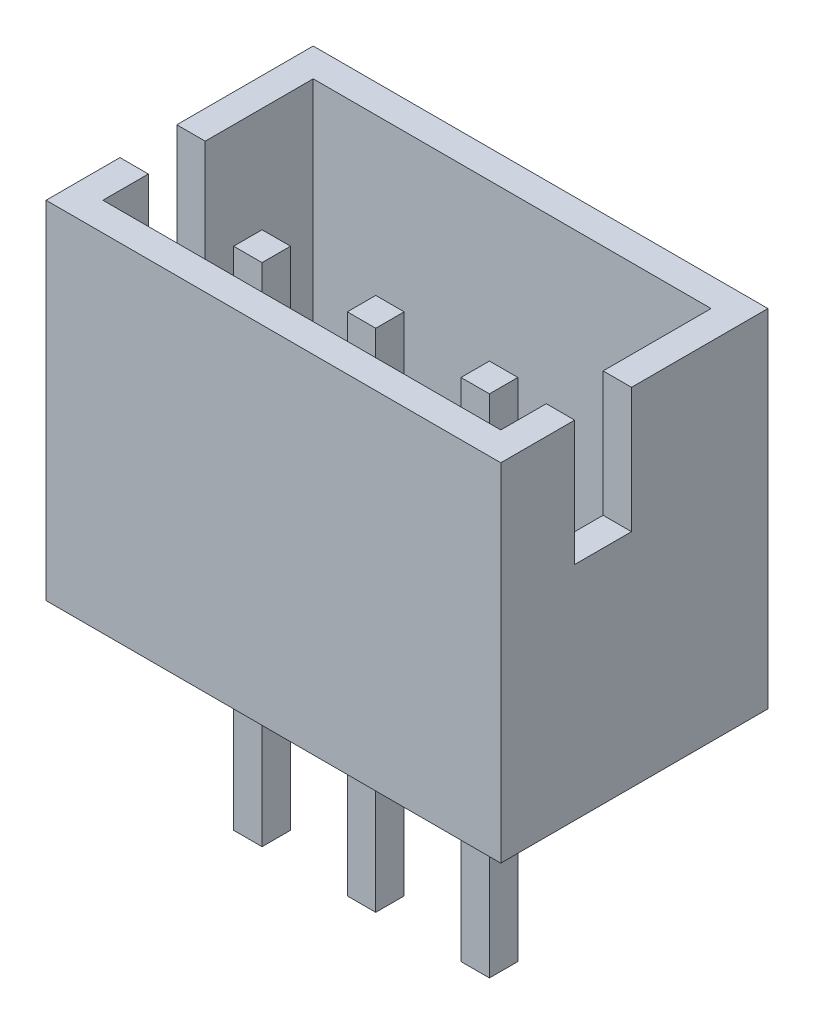
ISO-10303-21;
HEADER;
FILE_DESCRIPTION(('STEP AP214'),'2;1');
FILE_NAME('part.step','',(''),(''),'','','');
FILE_SCHEMA(('AUTOMOTIVE_DESIGN { 1 0 10303 214 1 1 1 1 }'));
ENDSEC;
DATA;
#1=APPLICATION_CONTEXT('core data for automotive mechanical design processes');
#2=APPLICATION_PROTOCOL_DEFINITION('international standard','automotive_design',2000,#1);
#3=PRODUCT_CONTEXT('',#1,'mechanical');
#4=PRODUCT('Part','Part','',(#3));
#5=PRODUCT_RELATED_PRODUCT_CATEGORY('part','',(#4));
#6=PRODUCT_DEFINITION_FORMATION('','',#4);
#7=PRODUCT_DEFINITION_CONTEXT('part definition',#1,'design');
#8=PRODUCT_DEFINITION('design','',#6,#7);
#9=PRODUCT_DEFINITION_SHAPE('','',#8);
#10=(LENGTH_UNIT() NAMED_UNIT(*) SI_UNIT(.MILLI.,.METRE.));
#11=(NAMED_UNIT(*) PLANE_ANGLE_UNIT() SI_UNIT($,.RADIAN.));
#12=(NAMED_UNIT(*) SI_UNIT($,.STERADIAN.) SOLID_ANGLE_UNIT());
#13=UNCERTAINTY_MEASURE_WITH_UNIT(LENGTH_MEASURE(1.E-05),#10,'distance_accuracy_value','');
#14=(GEOMETRIC_REPRESENTATION_CONTEXT(3) GLOBAL_UNCERTAINTY_ASSIGNED_CONTEXT((#13)) GLOBAL_UNIT_ASSIGNED_CONTEXT((#10,
#11,#12)) REPRESENTATION_CONTEXT('',''));
#15=CARTESIAN_POINT('',(0.,0.,0.));
#16=DIRECTION('',(0.,0.,1.));
#17=DIRECTION('',(1.,0.,0.));
#18=AXIS2_PLACEMENT_3D('',#15,#16,#17);
#19=CARTESIAN_POINT('',(2.25,-3.4,0.3));
#20=DIRECTION('',(0.,0.,-1.));
#21=DIRECTION('',(-1.,0.,0.));
#22=AXIS2_PLACEMENT_3D('',#19,#20,#21);
#23=PLANE('',#22);
#24=DIRECTION('',(0.,1.,0.));
#25=VECTOR('',#24,1.);
#26=CARTESIAN_POINT('',(1.75,-3.4,0.3));
#27=LINE('',#26,#25);
#28=CARTESIAN_POINT('',(1.75,-3.4,0.3));
#29=VERTEX_POINT('',#28);
#30=CARTESIAN_POINT('',(1.75,5.5,0.3));
#31=VERTEX_POINT('',#30);
#32=EDGE_CURVE('E53',#29,#31,#27,.T.);
#33=ORIENTED_EDGE('',*,*,#32,.T.);
#34=DIRECTION('',(-1.,0.,0.));
#35=VECTOR('',#34,1.);
#36=CARTESIAN_POINT('',(2.25,5.5,0.3));
#37=LINE('',#36,#35);
#38=CARTESIAN_POINT('',(2.25,5.5,0.3));
#39=VERTEX_POINT('',#38);
#40=EDGE_CURVE('E90',#39,#31,#37,.T.);
#41=ORIENTED_EDGE('',*,*,#40,.F.);
#42=DIRECTION('',(0.,1.,0.));
#43=VECTOR('',#42,1.);
#44=CARTESIAN_POINT('',(2.25,-3.4,0.3));
#45=LINE('',#44,#43);
#46=CARTESIAN_POINT('',(2.25,-3.4,0.3));
#47=VERTEX_POINT('',#46);
#48=EDGE_CURVE('E12',#47,#39,#45,.T.);
#49=ORIENTED_EDGE('',*,*,#48,.F.);
#50=DIRECTION('',(-1.,0.,0.));
#51=VECTOR('',#50,1.);
#52=CARTESIAN_POINT('',(2.25,-3.4,0.3));
#53=LINE('',#52,#51);
#54=EDGE_CURVE('E91',#47,#29,#53,.T.);
#55=ORIENTED_EDGE('',*,*,#54,.T.);
#56=EDGE_LOOP('',(#33,#41,#49,#55));
#57=FACE_BOUND('',#56,.T.);
#58=ADVANCED_FACE('F50',(#57),#23,.T.);
#59=CARTESIAN_POINT('',(2.25,-3.4,0.8));
#60=DIRECTION('',(1.,0.,0.));
#61=DIRECTION('',(0.,0.,-1.));
#62=AXIS2_PLACEMENT_3D('',#59,#60,#61);
#63=PLANE('',#62);
#64=ORIENTED_EDGE('',*,*,#48,.T.);
#65=DIRECTION('',(0.,0.,-1.));
#66=VECTOR('',#65,1.);
#67=CARTESIAN_POINT('',(2.25,5.5,0.8));
#68=LINE('',#67,#66);
#69=CARTESIAN_POINT('',(2.25,5.5,0.8));
#70=VERTEX_POINT('',#69);
#71=EDGE_CURVE('E107',#70,#39,#68,.T.);
#72=ORIENTED_EDGE('',*,*,#71,.F.);
#73=DIRECTION('',(0.,1.,0.));
#74=VECTOR('',#73,1.);
#75=CARTESIAN_POINT('',(2.25,-3.4,0.8));
#76=LINE('',#75,#74);
#77=CARTESIAN_POINT('',(2.25,-3.4,0.8));
#78=VERTEX_POINT('',#77);
#79=EDGE_CURVE('E58',#78,#70,#76,.T.);
#80=ORIENTED_EDGE('',*,*,#79,.F.);
#81=DIRECTION('',(0.,0.,-1.));
#82=VECTOR('',#81,1.);
#83=CARTESIAN_POINT('',(2.25,-3.4,0.8));
#84=LINE('',#83,#82);
#85=EDGE_CURVE('E96',#78,#47,#84,.T.);
#86=ORIENTED_EDGE('',*,*,#85,.T.);
#87=EDGE_LOOP('',(#64,#72,#80,#86));
#88=FACE_BOUND('',#87,.T.);
#89=ADVANCED_FACE('F122',(#88),#63,.T.);
#90=CARTESIAN_POINT('',(2.25,-3.4,0.8));
#91=DIRECTION('',(0.,0.,1.));
#92=DIRECTION('',(1.,0.,0.));
#93=AXIS2_PLACEMENT_3D('',#90,#91,#92);
#94=PLANE('',#93);
#95=ORIENTED_EDGE('',*,*,#79,.T.);
#96=DIRECTION('',(1.,0.,0.));
#97=VECTOR('',#96,1.);
#98=CARTESIAN_POINT('',(2.25,5.5,0.8));
#99=LINE('',#98,#97);
#100=CARTESIAN_POINT('',(1.75,5.5,0.8));
#101=VERTEX_POINT('',#100);
#102=EDGE_CURVE('E103',#101,#70,#99,.T.);
#103=ORIENTED_EDGE('',*,*,#102,.F.);
#104=DIRECTION('',(0.,1.,0.));
#105=VECTOR('',#104,1.);
#106=CARTESIAN_POINT('',(1.75,-3.4,0.8));
#107=LINE('',#106,#105);
#108=CARTESIAN_POINT('',(1.75,-3.4,0.8));
#109=VERTEX_POINT('',#108);
#110=EDGE_CURVE('E95',#109,#101,#107,.T.);
#111=ORIENTED_EDGE('',*,*,#110,.F.);
#112=DIRECTION('',(1.,0.,0.));
#113=VECTOR('',#112,1.);
#114=CARTESIAN_POINT('',(2.25,-3.4,0.8));
#115=LINE('',#114,#113);
#116=EDGE_CURVE('E115',#109,#78,#115,.T.);
#117=ORIENTED_EDGE('',*,*,#116,.T.);
#118=EDGE_LOOP('',(#95,#103,#111,#117));
#119=FACE_BOUND('',#118,.T.);
#120=ADVANCED_FACE('F119',(#119),#94,.T.);
#121=CARTESIAN_POINT('',(1.75,-3.4,0.8));
#122=DIRECTION('',(-1.,0.,0.));
#123=DIRECTION('',(0.,0.,1.));
#124=AXIS2_PLACEMENT_3D('',#121,#122,#123);
#125=PLANE('',#124);
#126=ORIENTED_EDGE('',*,*,#110,.T.);
#127=DIRECTION('',(0.,0.,1.));
#128=VECTOR('',#127,1.);
#129=CARTESIAN_POINT('',(1.75,5.5,0.8));
#130=LINE('',#129,#128);
#131=EDGE_CURVE('E98',#31,#101,#130,.T.);
#132=ORIENTED_EDGE('',*,*,#131,.F.);
#133=ORIENTED_EDGE('',*,*,#32,.F.);
#134=DIRECTION('',(0.,0.,1.));
#135=VECTOR('',#134,1.);
#136=CARTESIAN_POINT('',(1.75,-3.4,0.8));
#137=LINE('',#136,#135);
#138=EDGE_CURVE('E113',#29,#109,#137,.T.);
#139=ORIENTED_EDGE('',*,*,#138,.T.);
#140=EDGE_LOOP('',(#126,#132,#133,#139));
#141=FACE_BOUND('',#140,.T.);
#142=ADVANCED_FACE('F99',(#141),#125,.T.);
#143=CARTESIAN_POINT('',(0.,-3.4,0.));
#144=DIRECTION('',(0.,-1.,0.));
#145=DIRECTION('',(0.,0.,-1.));
#146=AXIS2_PLACEMENT_3D('',#143,#144,#145);
#147=PLANE('',#146);
#148=ORIENTED_EDGE('',*,*,#54,.F.);
#149=ORIENTED_EDGE('',*,*,#85,.F.);
#150=ORIENTED_EDGE('',*,*,#116,.F.);
#151=ORIENTED_EDGE('',*,*,#138,.F.);
#152=EDGE_LOOP('',(#148,#149,#150,#151));
#153=FACE_BOUND('',#152,.T.);
#154=ADVANCED_FACE('F124',(#153),#147,.T.);
#155=CARTESIAN_POINT('',(0.,5.5,0.));
#156=DIRECTION('',(0.,-1.,0.));
#157=DIRECTION('',(0.,0.,-1.));
#158=AXIS2_PLACEMENT_3D('',#155,#156,#157);
#159=PLANE('',#158);
#160=ORIENTED_EDGE('',*,*,#40,.T.);
#161=ORIENTED_EDGE('',*,*,#131,.T.);
#162=ORIENTED_EDGE('',*,*,#102,.T.);
#163=ORIENTED_EDGE('',*,*,#71,.T.);
#164=EDGE_LOOP('',(#160,#161,#162,#163));
#165=FACE_BOUND('',#164,.T.);
#166=ADVANCED_FACE('F106',(#165),#159,.F.);
#167=CLOSED_SHELL('',(#58,#89,#120,#142,#154,#166));
#168=MANIFOLD_SOLID_BREP('B2',#167);
#169=CARTESIAN_POINT('',(0.25,-3.4,0.3));
#170=DIRECTION('',(0.,0.,-1.));
#171=DIRECTION('',(-1.,0.,0.));
#172=AXIS2_PLACEMENT_3D('',#169,#170,#171);
#173=PLANE('',#172);
#174=DIRECTION('',(0.,1.,0.));
#175=VECTOR('',#174,1.);
#176=CARTESIAN_POINT('',(-0.25,-3.4,0.3));
#177=LINE('',#176,#175);
#178=CARTESIAN_POINT('',(-0.25,-3.4,0.3));
#179=VERTEX_POINT('',#178);
#180=CARTESIAN_POINT('',(-0.25,5.5,0.3));
#181=VERTEX_POINT('',#180);
#182=EDGE_CURVE('E187',#179,#181,#177,.T.);
#183=ORIENTED_EDGE('',*,*,#182,.T.);
#184=DIRECTION('',(-1.,0.,0.));
#185=VECTOR('',#184,1.);
#186=CARTESIAN_POINT('',(0.25,5.5,0.3));
#187=LINE('',#186,#185);
#188=CARTESIAN_POINT('',(0.25,5.5,0.3));
#189=VERTEX_POINT('',#188);
#190=EDGE_CURVE('E224',#189,#181,#187,.T.);
#191=ORIENTED_EDGE('',*,*,#190,.F.);
#192=DIRECTION('',(0.,1.,0.));
#193=VECTOR('',#192,1.);
#194=CARTESIAN_POINT('',(0.25,-3.4,0.3));
#195=LINE('',#194,#193);
#196=CARTESIAN_POINT('',(0.25,-3.4,0.3));
#197=VERTEX_POINT('',#196);
#198=EDGE_CURVE('E48',#197,#189,#195,.T.);
#199=ORIENTED_EDGE('',*,*,#198,.F.);
#200=DIRECTION('',(-1.,0.,0.));
#201=VECTOR('',#200,1.);
#202=CARTESIAN_POINT('',(0.25,-3.4,0.3));
#203=LINE('',#202,#201);
#204=EDGE_CURVE('E225',#197,#179,#203,.T.);
#205=ORIENTED_EDGE('',*,*,#204,.T.);
#206=EDGE_LOOP('',(#183,#191,#199,#205));
#207=FACE_BOUND('',#206,.T.);
#208=ADVANCED_FACE('F184',(#207),#173,.T.);
#209=CARTESIAN_POINT('',(0.25,-3.4,0.8));
#210=DIRECTION('',(1.,0.,0.));
#211=DIRECTION('',(0.,0.,-1.));
#212=AXIS2_PLACEMENT_3D('',#209,#210,#211);
#213=PLANE('',#212);
#214=ORIENTED_EDGE('',*,*,#198,.T.);
#215=DIRECTION('',(0.,0.,-1.));
#216=VECTOR('',#215,1.);
#217=CARTESIAN_POINT('',(0.25,5.5,0.8));
#218=LINE('',#217,#216);
#219=CARTESIAN_POINT('',(0.25,5.5,0.8));
#220=VERTEX_POINT('',#219);
#221=EDGE_CURVE('E241',#220,#189,#218,.T.);
#222=ORIENTED_EDGE('',*,*,#221,.F.);
#223=DIRECTION('',(0.,1.,0.));
#224=VECTOR('',#223,1.);
#225=CARTESIAN_POINT('',(0.25,-3.4,0.8));
#226=LINE('',#225,#224);
#227=CARTESIAN_POINT('',(0.25,-3.4,0.8));
#228=VERTEX_POINT('',#227);
#229=EDGE_CURVE('E192',#228,#220,#226,.T.);
#230=ORIENTED_EDGE('',*,*,#229,.F.);
#231=DIRECTION('',(0.,0.,-1.));
#232=VECTOR('',#231,1.);
#233=CARTESIAN_POINT('',(0.25,-3.4,0.8));
#234=LINE('',#233,#232);
#235=EDGE_CURVE('E230',#228,#197,#234,.T.);
#236=ORIENTED_EDGE('',*,*,#235,.T.);
#237=EDGE_LOOP('',(#214,#222,#230,#236));
#238=FACE_BOUND('',#237,.T.);
#239=ADVANCED_FACE('F256',(#238),#213,.T.);
#240=CARTESIAN_POINT('',(0.25,-3.4,0.8));
#241=DIRECTION('',(0.,0.,1.));
#242=DIRECTION('',(1.,0.,0.));
#243=AXIS2_PLACEMENT_3D('',#240,#241,#242);
#244=PLANE('',#243);
#245=ORIENTED_EDGE('',*,*,#229,.T.);
#246=DIRECTION('',(1.,0.,0.));
#247=VECTOR('',#246,1.);
#248=CARTESIAN_POINT('',(0.25,5.5,0.8));
#249=LINE('',#248,#247);
#250=CARTESIAN_POINT('',(-0.25,5.5,0.8));
#251=VERTEX_POINT('',#250);
#252=EDGE_CURVE('E237',#251,#220,#249,.T.);
#253=ORIENTED_EDGE('',*,*,#252,.F.);
#254=DIRECTION('',(0.,1.,0.));
#255=VECTOR('',#254,1.);
#256=CARTESIAN_POINT('',(-0.25,-3.4,0.8));
#257=LINE('',#256,#255);
#258=CARTESIAN_POINT('',(-0.25,-3.4,0.8));
#259=VERTEX_POINT('',#258);
#260=EDGE_CURVE('E229',#259,#251,#257,.T.);
#261=ORIENTED_EDGE('',*,*,#260,.F.);
#262=DIRECTION('',(1.,0.,0.));
#263=VECTOR('',#262,1.);
#264=CARTESIAN_POINT('',(0.25,-3.4,0.8));
#265=LINE('',#264,#263);
#266=EDGE_CURVE('E249',#259,#228,#265,.T.);
#267=ORIENTED_EDGE('',*,*,#266,.T.);
#268=EDGE_LOOP('',(#245,#253,#261,#267));
#269=FACE_BOUND('',#268,.T.);
#270=ADVANCED_FACE('F253',(#269),#244,.T.);
#271=CARTESIAN_POINT('',(-0.25,-3.4,0.8));
#272=DIRECTION('',(-1.,0.,0.));
#273=DIRECTION('',(0.,0.,1.));
#274=AXIS2_PLACEMENT_3D('',#271,#272,#273);
#275=PLANE('',#274);
#276=ORIENTED_EDGE('',*,*,#260,.T.);
#277=DIRECTION('',(0.,0.,1.));
#278=VECTOR('',#277,1.);
#279=CARTESIAN_POINT('',(-0.25,5.5,0.8));
#280=LINE('',#279,#278);
#281=EDGE_CURVE('E232',#181,#251,#280,.T.);
#282=ORIENTED_EDGE('',*,*,#281,.F.);
#283=ORIENTED_EDGE('',*,*,#182,.F.);
#284=DIRECTION('',(0.,0.,1.));
#285=VECTOR('',#284,1.);
#286=CARTESIAN_POINT('',(-0.25,-3.4,0.8));
#287=LINE('',#286,#285);
#288=EDGE_CURVE('E247',#179,#259,#287,.T.);
#289=ORIENTED_EDGE('',*,*,#288,.T.);
#290=EDGE_LOOP('',(#276,#282,#283,#289));
#291=FACE_BOUND('',#290,.T.);
#292=ADVANCED_FACE('F233',(#291),#275,.T.);
#293=CARTESIAN_POINT('',(0.,-3.4,0.));
#294=DIRECTION('',(0.,-1.,0.));
#295=DIRECTION('',(0.,0.,-1.));
#296=AXIS2_PLACEMENT_3D('',#293,#294,#295);
#297=PLANE('',#296);
#298=ORIENTED_EDGE('',*,*,#204,.F.);
#299=ORIENTED_EDGE('',*,*,#235,.F.);
#300=ORIENTED_EDGE('',*,*,#266,.F.);
#301=ORIENTED_EDGE('',*,*,#288,.F.);
#302=EDGE_LOOP('',(#298,#299,#300,#301));
#303=FACE_BOUND('',#302,.T.);
#304=ADVANCED_FACE('F258',(#303),#297,.T.);
#305=CARTESIAN_POINT('',(0.,5.5,0.));
#306=DIRECTION('',(0.,-1.,0.));
#307=DIRECTION('',(0.,0.,-1.));
#308=AXIS2_PLACEMENT_3D('',#305,#306,#307);
#309=PLANE('',#308);
#310=ORIENTED_EDGE('',*,*,#190,.T.);
#311=ORIENTED_EDGE('',*,*,#281,.T.);
#312=ORIENTED_EDGE('',*,*,#252,.T.);
#313=ORIENTED_EDGE('',*,*,#221,.T.);
#314=EDGE_LOOP('',(#310,#311,#312,#313));
#315=FACE_BOUND('',#314,.T.);
#316=ADVANCED_FACE('F240',(#315),#309,.F.);
#317=CLOSED_SHELL('',(#208,#239,#270,#292,#304,#316));
#318=MANIFOLD_SOLID_BREP('B6',#317);
#319=CARTESIAN_POINT('',(-2.25,-3.4,0.8));
#320=DIRECTION('',(-1.,0.,0.));
#321=DIRECTION('',(0.,0.,1.));
#322=AXIS2_PLACEMENT_3D('',#319,#320,#321);
#323=PLANE('',#322);
#324=DIRECTION('',(0.,1.,0.));
#325=VECTOR('',#324,1.);
#326=CARTESIAN_POINT('',(-2.25,-3.4,0.8));
#327=LINE('',#326,#325);
#328=CARTESIAN_POINT('',(-2.25,-3.4,0.8));
#329=VERTEX_POINT('',#328);
#330=CARTESIAN_POINT('',(-2.25,5.5,0.8));
#331=VERTEX_POINT('',#330);
#332=EDGE_CURVE('E320',#329,#331,#327,.T.);
#333=ORIENTED_EDGE('',*,*,#332,.T.);
#334=DIRECTION('',(0.,0.,1.));
#335=VECTOR('',#334,1.);
#336=CARTESIAN_POINT('',(-2.25,5.5,0.8));
#337=LINE('',#336,#335);
#338=CARTESIAN_POINT('',(-2.25,5.5,0.3));
#339=VERTEX_POINT('',#338);
#340=EDGE_CURVE('E357',#339,#331,#337,.T.);
#341=ORIENTED_EDGE('',*,*,#340,.F.);
#342=DIRECTION('',(0.,1.,0.));
#343=VECTOR('',#342,1.);
#344=CARTESIAN_POINT('',(-2.25,-3.4,0.3));
#345=LINE('',#344,#343);
#346=CARTESIAN_POINT('',(-2.25,-3.4,0.3));
#347=VERTEX_POINT('',#346);
#348=EDGE_CURVE('E182',#347,#339,#345,.T.);
#349=ORIENTED_EDGE('',*,*,#348,.F.);
#350=DIRECTION('',(0.,0.,1.));
#351=VECTOR('',#350,1.);
#352=CARTESIAN_POINT('',(-2.25,-3.4,0.8));
#353=LINE('',#352,#351);
#354=EDGE_CURVE('E358',#347,#329,#353,.T.);
#355=ORIENTED_EDGE('',*,*,#354,.T.);
#356=EDGE_LOOP('',(#333,#341,#349,#355));
#357=FACE_BOUND('',#356,.T.);
#358=ADVANCED_FACE('F317',(#357),#323,.T.);
#359=CARTESIAN_POINT('',(-1.75,-3.4,0.3));
#360=DIRECTION('',(0.,0.,-1.));
#361=DIRECTION('',(-1.,0.,0.));
#362=AXIS2_PLACEMENT_3D('',#359,#360,#361);
#363=PLANE('',#362);
#364=ORIENTED_EDGE('',*,*,#348,.T.);
#365=DIRECTION('',(-1.,0.,0.));
#366=VECTOR('',#365,1.);
#367=CARTESIAN_POINT('',(-1.75,5.5,0.3));
#368=LINE('',#367,#366);
#369=CARTESIAN_POINT('',(-1.75,5.5,0.3));
#370=VERTEX_POINT('',#369);
#371=EDGE_CURVE('E374',#370,#339,#368,.T.);
#372=ORIENTED_EDGE('',*,*,#371,.F.);
#373=DIRECTION('',(0.,1.,0.));
#374=VECTOR('',#373,1.);
#375=CARTESIAN_POINT('',(-1.75,-3.4,0.3));
#376=LINE('',#375,#374);
#377=CARTESIAN_POINT('',(-1.75,-3.4,0.3));
#378=VERTEX_POINT('',#377);
#379=EDGE_CURVE('E325',#378,#370,#376,.T.);
#380=ORIENTED_EDGE('',*,*,#379,.F.);
#381=DIRECTION('',(-1.,0.,0.));
#382=VECTOR('',#381,1.);
#383=CARTESIAN_POINT('',(-1.75,-3.4,0.3));
#384=LINE('',#383,#382);
#385=EDGE_CURVE('E363',#378,#347,#384,.T.);
#386=ORIENTED_EDGE('',*,*,#385,.T.);
#387=EDGE_LOOP('',(#364,#372,#380,#386));
#388=FACE_BOUND('',#387,.T.);
#389=ADVANCED_FACE('F389',(#388),#363,.T.);
#390=CARTESIAN_POINT('',(-1.75,-3.4,0.8));
#391=DIRECTION('',(1.,0.,0.));
#392=DIRECTION('',(0.,0.,-1.));
#393=AXIS2_PLACEMENT_3D('',#390,#391,#392);
#394=PLANE('',#393);
#395=ORIENTED_EDGE('',*,*,#379,.T.);
#396=DIRECTION('',(0.,0.,-1.));
#397=VECTOR('',#396,1.);
#398=CARTESIAN_POINT('',(-1.75,5.5,0.8));
#399=LINE('',#398,#397);
#400=CARTESIAN_POINT('',(-1.75,5.5,0.8));
#401=VERTEX_POINT('',#400);
#402=EDGE_CURVE('E370',#401,#370,#399,.T.);
#403=ORIENTED_EDGE('',*,*,#402,.F.);
#404=DIRECTION('',(0.,1.,0.));
#405=VECTOR('',#404,1.);
#406=CARTESIAN_POINT('',(-1.75,-3.4,0.8));
#407=LINE('',#406,#405);
#408=CARTESIAN_POINT('',(-1.75,-3.4,0.8));
#409=VERTEX_POINT('',#408);
#410=EDGE_CURVE('E362',#409,#401,#407,.T.);
#411=ORIENTED_EDGE('',*,*,#410,.F.);
#412=DIRECTION('',(0.,0.,-1.));
#413=VECTOR('',#412,1.);
#414=CARTESIAN_POINT('',(-1.75,-3.4,0.8));
#415=LINE('',#414,#413);
#416=EDGE_CURVE('E382',#409,#378,#415,.T.);
#417=ORIENTED_EDGE('',*,*,#416,.T.);
#418=EDGE_LOOP('',(#395,#403,#411,#417));
#419=FACE_BOUND('',#418,.T.);
#420=ADVANCED_FACE('F386',(#419),#394,.T.);
#421=CARTESIAN_POINT('',(-1.75,-3.4,0.8));
#422=DIRECTION('',(0.,0.,1.));
#423=DIRECTION('',(1.,0.,0.));
#424=AXIS2_PLACEMENT_3D('',#421,#422,#423);
#425=PLANE('',#424);
#426=ORIENTED_EDGE('',*,*,#410,.T.);
#427=DIRECTION('',(1.,0.,0.));
#428=VECTOR('',#427,1.);
#429=CARTESIAN_POINT('',(-1.75,5.5,0.8));
#430=LINE('',#429,#428);
#431=EDGE_CURVE('E365',#331,#401,#430,.T.);
#432=ORIENTED_EDGE('',*,*,#431,.F.);
#433=ORIENTED_EDGE('',*,*,#332,.F.);
#434=DIRECTION('',(1.,0.,0.));
#435=VECTOR('',#434,1.);
#436=CARTESIAN_POINT('',(-1.75,-3.4,0.8));
#437=LINE('',#436,#435);
#438=EDGE_CURVE('E380',#329,#409,#437,.T.);
#439=ORIENTED_EDGE('',*,*,#438,.T.);
#440=EDGE_LOOP('',(#426,#432,#433,#439));
#441=FACE_BOUND('',#440,.T.);
#442=ADVANCED_FACE('F366',(#441),#425,.T.);
#443=CARTESIAN_POINT('',(0.,-3.4,0.));
#444=DIRECTION('',(0.,1.,0.));
#445=DIRECTION('',(0.,0.,1.));
#446=AXIS2_PLACEMENT_3D('',#443,#444,#445);
#447=PLANE('',#446);
#448=ORIENTED_EDGE('',*,*,#354,.F.);
#449=ORIENTED_EDGE('',*,*,#385,.F.);
#450=ORIENTED_EDGE('',*,*,#416,.F.);
#451=ORIENTED_EDGE('',*,*,#438,.F.);
#452=EDGE_LOOP('',(#448,#449,#450,#451));
#453=FACE_BOUND('',#452,.T.);
#454=ADVANCED_FACE('F391',(#453),#447,.F.);
#455=CARTESIAN_POINT('',(0.,5.5,0.));
#456=DIRECTION('',(0.,1.,0.));
#457=DIRECTION('',(0.,0.,1.));
#458=AXIS2_PLACEMENT_3D('',#455,#456,#457);
#459=PLANE('',#458);
#460=ORIENTED_EDGE('',*,*,#340,.T.);
#461=ORIENTED_EDGE('',*,*,#431,.T.);
#462=ORIENTED_EDGE('',*,*,#402,.T.);
#463=ORIENTED_EDGE('',*,*,#371,.T.);
#464=EDGE_LOOP('',(#460,#461,#462,#463));
#465=FACE_BOUND('',#464,.T.);
#466=ADVANCED_FACE('F373',(#465),#459,.T.);
#467=CLOSED_SHELL('',(#358,#389,#420,#442,#454,#466));
#468=MANIFOLD_SOLID_BREP('B42',#467);
#469=CARTESIAN_POINT('',(4.,6.1,2.35));
#470=DIRECTION('',(-1.,0.,0.));
#471=DIRECTION('',(0.,0.,1.));
#472=AXIS2_PLACEMENT_3D('',#469,#470,#471);
#473=PLANE('',#472);
#474=DIRECTION('',(0.,1.,0.));
#475=VECTOR('',#474,1.);
#476=CARTESIAN_POINT('',(4.,3.9,1.05));
#477=LINE('',#476,#475);
#478=CARTESIAN_POINT('',(4.,3.9,1.05));
#479=VERTEX_POINT('',#478);
#480=CARTESIAN_POINT('',(4.,6.1,1.05));
#481=VERTEX_POINT('',#480);
#482=EDGE_CURVE('E562',#479,#481,#477,.T.);
#483=ORIENTED_EDGE('',*,*,#482,.T.);
#484=DIRECTION('',(0.,0.,-1.));
#485=VECTOR('',#484,1.);
#486=CARTESIAN_POINT('',(4.,6.1,2.35));
#487=LINE('',#486,#485);
#488=CARTESIAN_POINT('',(4.,6.1,2.35));
#489=VERTEX_POINT('',#488);
#490=EDGE_CURVE('E580',#489,#481,#487,.T.);
#491=ORIENTED_EDGE('',*,*,#490,.F.);
#492=DIRECTION('',(0.,-1.,0.));
#493=VECTOR('',#492,1.);
#494=CARTESIAN_POINT('',(4.,6.1,2.35));
#495=LINE('',#494,#493);
#496=CARTESIAN_POINT('',(4.,0.,2.35));
#497=VERTEX_POINT('',#496);
#498=EDGE_CURVE('E614',#489,#497,#495,.T.);
#499=ORIENTED_EDGE('',*,*,#498,.T.);
#500=DIRECTION('',(0.,0.,-1.));
#501=VECTOR('',#500,1.);
#502=CARTESIAN_POINT('',(4.,0.,2.35));
#503=LINE('',#502,#501);
#504=CARTESIAN_POINT('',(4.,0.,-2.35));
#505=VERTEX_POINT('',#504);
#506=EDGE_CURVE('E602',#497,#505,#503,.T.);
#507=ORIENTED_EDGE('',*,*,#506,.T.);
#508=DIRECTION('',(0.,-1.,0.));
#509=VECTOR('',#508,1.);
#510=CARTESIAN_POINT('',(4.,6.1,-2.35));
#511=LINE('',#510,#509);
#512=CARTESIAN_POINT('',(4.,6.1,-2.35));
#513=VERTEX_POINT('',#512);
#514=EDGE_CURVE('E577',#513,#505,#511,.T.);
#515=ORIENTED_EDGE('',*,*,#514,.F.);
#516=CARTESIAN_POINT('',(4.,6.1,0.0499999999999996));
#517=VERTEX_POINT('',#516);
#518=EDGE_CURVE('E567',#517,#513,#487,.T.);
#519=ORIENTED_EDGE('',*,*,#518,.F.);
#520=DIRECTION('',(0.,-1.,0.));
#521=VECTOR('',#520,1.);
#522=CARTESIAN_POINT('',(4.,3.9,0.0499999999999996));
#523=LINE('',#522,#521);
#524=CARTESIAN_POINT('',(4.,3.9,0.0499999999999996));
#525=VERTEX_POINT('',#524);
#526=EDGE_CURVE('E553',#517,#525,#523,.T.);
#527=ORIENTED_EDGE('',*,*,#526,.T.);
#528=DIRECTION('',(0.,0.,1.));
#529=VECTOR('',#528,1.);
#530=CARTESIAN_POINT('',(4.,3.9,1.05));
#531=LINE('',#530,#529);
#532=EDGE_CURVE('E573',#525,#479,#531,.T.);
#533=ORIENTED_EDGE('',*,*,#532,.T.);
#534=EDGE_LOOP('',(#483,#491,#499,#507,#515,#519,#527,#533));
#535=FACE_BOUND('',#534,.T.);
#536=ADVANCED_FACE('F441',(#535),#473,.F.);
#537=CARTESIAN_POINT('',(0.,6.1,0.));
#538=DIRECTION('',(0.,1.,0.));
#539=DIRECTION('',(0.,0.,1.));
#540=AXIS2_PLACEMENT_3D('',#537,#538,#539);
#541=PLANE('',#540);
#542=ORIENTED_EDGE('',*,*,#490,.T.);
#543=DIRECTION('',(1.,0.,0.));
#544=VECTOR('',#543,1.);
#545=CARTESIAN_POINT('',(-5.91660919471891,6.1,1.05));
#546=LINE('',#545,#544);
#547=CARTESIAN_POINT('',(3.5,6.1,1.05));
#548=VERTEX_POINT('',#547);
#549=EDGE_CURVE('E572',#548,#481,#546,.T.);
#550=ORIENTED_EDGE('',*,*,#549,.F.);
#551=DIRECTION('',(0.,0.,-1.));
#552=VECTOR('',#551,1.);
#553=CARTESIAN_POINT('',(3.5,6.1,2.35));
#554=LINE('',#553,#552);
#555=CARTESIAN_POINT('',(3.5,6.1,1.85));
#556=VERTEX_POINT('',#555);
#557=EDGE_CURVE('E716',#556,#548,#554,.T.);
#558=ORIENTED_EDGE('',*,*,#557,.F.);
#559=DIRECTION('',(1.,0.,0.));
#560=VECTOR('',#559,1.);
#561=CARTESIAN_POINT('',(4.,6.1,1.85));
#562=LINE('',#561,#560);
#563=CARTESIAN_POINT('',(-3.5,6.1,1.85));
#564=VERTEX_POINT('',#563);
#565=EDGE_CURVE('E713',#564,#556,#562,.T.);
#566=ORIENTED_EDGE('',*,*,#565,.F.);
#567=DIRECTION('',(0.,0.,1.));
#568=VECTOR('',#567,1.);
#569=CARTESIAN_POINT('',(-3.5,6.1,2.35));
#570=LINE('',#569,#568);
#571=CARTESIAN_POINT('',(-3.5,6.1,1.05));
#572=VERTEX_POINT('',#571);
#573=EDGE_CURVE('E708',#572,#564,#570,.T.);
#574=ORIENTED_EDGE('',*,*,#573,.F.);
#575=DIRECTION('',(-1.,0.,0.));
#576=VECTOR('',#575,1.);
#577=CARTESIAN_POINT('',(-1.08339080528109,6.1,1.05));
#578=LINE('',#577,#576);
#579=CARTESIAN_POINT('',(-4.,6.1,1.05));
#580=VERTEX_POINT('',#579);
#581=EDGE_CURVE('E669',#572,#580,#578,.T.);
#582=ORIENTED_EDGE('',*,*,#581,.T.);
#583=DIRECTION('',(0.,0.,1.));
#584=VECTOR('',#583,1.);
#585=CARTESIAN_POINT('',(-4.,6.1,2.35));
#586=LINE('',#585,#584);
#587=CARTESIAN_POINT('',(-4.,6.1,2.35));
#588=VERTEX_POINT('',#587);
#589=EDGE_CURVE('E608',#580,#588,#586,.T.);
#590=ORIENTED_EDGE('',*,*,#589,.T.);
#591=DIRECTION('',(1.,0.,0.));
#592=VECTOR('',#591,1.);
#593=CARTESIAN_POINT('',(4.,6.1,2.35));
#594=LINE('',#593,#592);
#595=EDGE_CURVE('E581',#588,#489,#594,.T.);
#596=ORIENTED_EDGE('',*,*,#595,.T.);
#597=EDGE_LOOP('',(#542,#550,#558,#566,#574,#582,#590,#596));
#598=FACE_BOUND('',#597,.T.);
#599=ADVANCED_FACE('F728',(#598),#541,.T.);
#600=CARTESIAN_POINT('',(3.5,6.1,0.0499999999999997));
#601=VERTEX_POINT('',#600);
#602=CARTESIAN_POINT('',(3.5,6.1,-1.85));
#603=VERTEX_POINT('',#602);
#604=EDGE_CURVE('E570',#601,#603,#554,.T.);
#605=ORIENTED_EDGE('',*,*,#604,.F.);
#606=DIRECTION('',(1.,0.,0.));
#607=VECTOR('',#606,1.);
#608=CARTESIAN_POINT('',(-5.91660919471891,6.1,0.0499999999999996));
#609=LINE('',#608,#607);
#610=EDGE_CURVE('E457',#601,#517,#609,.T.);
#611=ORIENTED_EDGE('',*,*,#610,.T.);
#612=ORIENTED_EDGE('',*,*,#518,.T.);
#613=DIRECTION('',(-1.,0.,0.));
#614=VECTOR('',#613,1.);
#615=CARTESIAN_POINT('',(4.,6.1,-2.35));
#616=LINE('',#615,#614);
#617=CARTESIAN_POINT('',(-4.,6.1,-2.35));
#618=VERTEX_POINT('',#617);
#619=EDGE_CURVE('E586',#513,#618,#616,.T.);
#620=ORIENTED_EDGE('',*,*,#619,.T.);
#621=CARTESIAN_POINT('',(-4.,6.1,0.0499999999999996));
#622=VERTEX_POINT('',#621);
#623=EDGE_CURVE('E587',#618,#622,#586,.T.);
#624=ORIENTED_EDGE('',*,*,#623,.T.);
#625=DIRECTION('',(-1.,0.,0.));
#626=VECTOR('',#625,1.);
#627=CARTESIAN_POINT('',(-1.08339080528109,6.1,0.0499999999999996));
#628=LINE('',#627,#626);
#629=CARTESIAN_POINT('',(-3.5,6.1,0.0499999999999995));
#630=VERTEX_POINT('',#629);
#631=EDGE_CURVE('E664',#630,#622,#628,.T.);
#632=ORIENTED_EDGE('',*,*,#631,.F.);
#633=CARTESIAN_POINT('',(-3.5,6.1,-1.85));
#634=VERTEX_POINT('',#633);
#635=EDGE_CURVE('E709',#634,#630,#570,.T.);
#636=ORIENTED_EDGE('',*,*,#635,.F.);
#637=DIRECTION('',(-1.,0.,0.));
#638=VECTOR('',#637,1.);
#639=CARTESIAN_POINT('',(4.,6.1,-1.85));
#640=LINE('',#639,#638);
#641=EDGE_CURVE('E693',#603,#634,#640,.T.);
#642=ORIENTED_EDGE('',*,*,#641,.F.);
#643=EDGE_LOOP('',(#605,#611,#612,#620,#624,#632,#636,#642));
#644=FACE_BOUND('',#643,.T.);
#645=ADVANCED_FACE('F566',(#644),#541,.T.);
#646=CARTESIAN_POINT('',(3.5,6.1,2.35));
#647=DIRECTION('',(-1.,0.,0.));
#648=DIRECTION('',(0.,0.,1.));
#649=AXIS2_PLACEMENT_3D('',#646,#647,#648);
#650=PLANE('',#649);
#651=ORIENTED_EDGE('',*,*,#557,.T.);
#652=DIRECTION('',(0.,-1.,0.));
#653=VECTOR('',#652,1.);
#654=CARTESIAN_POINT('',(3.5,6.1,1.05));
#655=LINE('',#654,#653);
#656=CARTESIAN_POINT('',(3.5,3.9,1.05));
#657=VERTEX_POINT('',#656);
#658=EDGE_CURVE('E315',#548,#657,#655,.T.);
#659=ORIENTED_EDGE('',*,*,#658,.T.);
#660=DIRECTION('',(0.,0.,-1.));
#661=VECTOR('',#660,1.);
#662=CARTESIAN_POINT('',(3.5,3.9,2.35));
#663=LINE('',#662,#661);
#664=CARTESIAN_POINT('',(3.5,3.9,0.0499999999999996));
#665=VERTEX_POINT('',#664);
#666=EDGE_CURVE('E450',#657,#665,#663,.T.);
#667=ORIENTED_EDGE('',*,*,#666,.T.);
#668=DIRECTION('',(0.,1.,0.));
#669=VECTOR('',#668,1.);
#670=CARTESIAN_POINT('',(3.5,6.1,0.0499999999999997));
#671=LINE('',#670,#669);
#672=EDGE_CURVE('E622',#665,#601,#671,.T.);
#673=ORIENTED_EDGE('',*,*,#672,.T.);
#674=ORIENTED_EDGE('',*,*,#604,.T.);
#675=DIRECTION('',(0.,-1.,0.));
#676=VECTOR('',#675,1.);
#677=CARTESIAN_POINT('',(3.5,6.1,-1.85));
#678=LINE('',#677,#676);
#679=CARTESIAN_POINT('',(3.5,0.5,-1.85));
#680=VERTEX_POINT('',#679);
#681=EDGE_CURVE('E692',#603,#680,#678,.T.);
#682=ORIENTED_EDGE('',*,*,#681,.T.);
#683=DIRECTION('',(0.,0.,-1.));
#684=VECTOR('',#683,1.);
#685=CARTESIAN_POINT('',(3.5,0.5,2.35));
#686=LINE('',#685,#684);
#687=CARTESIAN_POINT('',(3.5,0.5,1.85));
#688=VERTEX_POINT('',#687);
#689=EDGE_CURVE('E696',#688,#680,#686,.T.);
#690=ORIENTED_EDGE('',*,*,#689,.F.);
#691=DIRECTION('',(0.,-1.,0.));
#692=VECTOR('',#691,1.);
#693=CARTESIAN_POINT('',(3.5,6.1,1.85));
#694=LINE('',#693,#692);
#695=EDGE_CURVE('E687',#556,#688,#694,.T.);
#696=ORIENTED_EDGE('',*,*,#695,.F.);
#697=EDGE_LOOP('',(#651,#659,#667,#673,#674,#682,#690,#696));
#698=FACE_BOUND('',#697,.T.);
#699=ADVANCED_FACE('F628',(#698),#650,.T.);
#700=CARTESIAN_POINT('',(-4.,6.1,2.35));
#701=DIRECTION('',(1.,0.,0.));
#702=DIRECTION('',(0.,0.,-1.));
#703=AXIS2_PLACEMENT_3D('',#700,#701,#702);
#704=PLANE('',#703);
#705=ORIENTED_EDGE('',*,*,#589,.F.);
#706=DIRECTION('',(0.,1.,0.));
#707=VECTOR('',#706,1.);
#708=CARTESIAN_POINT('',(-4.,3.9,1.05));
#709=LINE('',#708,#707);
#710=CARTESIAN_POINT('',(-4.,3.9,1.05));
#711=VERTEX_POINT('',#710);
#712=EDGE_CURVE('E646',#711,#580,#709,.T.);
#713=ORIENTED_EDGE('',*,*,#712,.F.);
#714=DIRECTION('',(0.,0.,1.));
#715=VECTOR('',#714,1.);
#716=CARTESIAN_POINT('',(-4.,3.9,1.05));
#717=LINE('',#716,#715);
#718=CARTESIAN_POINT('',(-4.,3.9,0.0499999999999996));
#719=VERTEX_POINT('',#718);
#720=EDGE_CURVE('E650',#719,#711,#717,.T.);
#721=ORIENTED_EDGE('',*,*,#720,.F.);
#722=DIRECTION('',(0.,-1.,0.));
#723=VECTOR('',#722,1.);
#724=CARTESIAN_POINT('',(-4.,3.9,0.0499999999999996));
#725=LINE('',#724,#723);
#726=EDGE_CURVE('E641',#622,#719,#725,.T.);
#727=ORIENTED_EDGE('',*,*,#726,.F.);
#728=ORIENTED_EDGE('',*,*,#623,.F.);
#729=DIRECTION('',(0.,-1.,0.));
#730=VECTOR('',#729,1.);
#731=CARTESIAN_POINT('',(-4.,6.1,-2.35));
#732=LINE('',#731,#730);
#733=CARTESIAN_POINT('',(-4.,0.,-2.35));
#734=VERTEX_POINT('',#733);
#735=EDGE_CURVE('E593',#618,#734,#732,.T.);
#736=ORIENTED_EDGE('',*,*,#735,.T.);
#737=DIRECTION('',(0.,0.,1.));
#738=VECTOR('',#737,1.);
#739=CARTESIAN_POINT('',(-4.,0.,2.35));
#740=LINE('',#739,#738);
#741=CARTESIAN_POINT('',(-4.,0.,2.35));
#742=VERTEX_POINT('',#741);
#743=EDGE_CURVE('E594',#734,#742,#740,.T.);
#744=ORIENTED_EDGE('',*,*,#743,.T.);
#745=DIRECTION('',(0.,-1.,0.));
#746=VECTOR('',#745,1.);
#747=CARTESIAN_POINT('',(-4.,6.1,2.35));
#748=LINE('',#747,#746);
#749=EDGE_CURVE('E618',#588,#742,#748,.T.);
#750=ORIENTED_EDGE('',*,*,#749,.F.);
#751=EDGE_LOOP('',(#705,#713,#721,#727,#728,#736,#744,#750));
#752=FACE_BOUND('',#751,.T.);
#753=ADVANCED_FACE('F443',(#752),#704,.F.);
#754=CARTESIAN_POINT('',(4.,6.1,2.35));
#755=DIRECTION('',(0.,0.,-1.));
#756=DIRECTION('',(-1.,0.,0.));
#757=AXIS2_PLACEMENT_3D('',#754,#755,#756);
#758=PLANE('',#757);
#759=DIRECTION('',(1.,0.,0.));
#760=VECTOR('',#759,1.);
#761=CARTESIAN_POINT('',(4.,0.,2.35));
#762=LINE('',#761,#760);
#763=EDGE_CURVE('E598',#742,#497,#762,.T.);
#764=ORIENTED_EDGE('',*,*,#763,.T.);
#765=ORIENTED_EDGE('',*,*,#498,.F.);
#766=ORIENTED_EDGE('',*,*,#595,.F.);
#767=ORIENTED_EDGE('',*,*,#749,.T.);
#768=EDGE_LOOP('',(#764,#765,#766,#767));
#769=FACE_BOUND('',#768,.T.);
#770=ADVANCED_FACE('F735',(#769),#758,.F.);
#771=CARTESIAN_POINT('',(4.,6.1,-2.35));
#772=DIRECTION('',(0.,0.,1.));
#773=DIRECTION('',(1.,0.,0.));
#774=AXIS2_PLACEMENT_3D('',#771,#772,#773);
#775=PLANE('',#774);
#776=DIRECTION('',(-1.,0.,0.));
#777=VECTOR('',#776,1.);
#778=CARTESIAN_POINT('',(4.,0.,-2.35));
#779=LINE('',#778,#777);
#780=EDGE_CURVE('E605',#505,#734,#779,.T.);
#781=ORIENTED_EDGE('',*,*,#780,.T.);
#782=ORIENTED_EDGE('',*,*,#735,.F.);
#783=ORIENTED_EDGE('',*,*,#619,.F.);
#784=ORIENTED_EDGE('',*,*,#514,.T.);
#785=EDGE_LOOP('',(#781,#782,#783,#784));
#786=FACE_BOUND('',#785,.T.);
#787=ADVANCED_FACE('F781',(#786),#775,.F.);
#788=CARTESIAN_POINT('',(0.,0.,0.));
#789=DIRECTION('',(0.,1.,0.));
#790=DIRECTION('',(0.,0.,1.));
#791=AXIS2_PLACEMENT_3D('',#788,#789,#790);
#792=PLANE('',#791);
#793=ORIENTED_EDGE('',*,*,#743,.F.);
#794=ORIENTED_EDGE('',*,*,#780,.F.);
#795=ORIENTED_EDGE('',*,*,#506,.F.);
#796=ORIENTED_EDGE('',*,*,#763,.F.);
#797=EDGE_LOOP('',(#793,#794,#795,#796));
#798=FACE_BOUND('',#797,.T.);
#799=ADVANCED_FACE('F741',(#798),#792,.F.);
#800=CARTESIAN_POINT('',(-3.5,6.1,2.35));
#801=DIRECTION('',(1.,0.,0.));
#802=DIRECTION('',(0.,0.,-1.));
#803=AXIS2_PLACEMENT_3D('',#800,#801,#802);
#804=PLANE('',#803);
#805=DIRECTION('',(0.,1.,0.));
#806=VECTOR('',#805,1.);
#807=CARTESIAN_POINT('',(-3.5,3.9,1.05));
#808=LINE('',#807,#806);
#809=CARTESIAN_POINT('',(-3.5,3.9,1.05));
#810=VERTEX_POINT('',#809);
#811=EDGE_CURVE('E665',#810,#572,#808,.T.);
#812=ORIENTED_EDGE('',*,*,#811,.T.);
#813=ORIENTED_EDGE('',*,*,#573,.T.);
#814=DIRECTION('',(0.,-1.,0.));
#815=VECTOR('',#814,1.);
#816=CARTESIAN_POINT('',(-3.5,6.1,1.85));
#817=LINE('',#816,#815);
#818=CARTESIAN_POINT('',(-3.5,0.5,1.85));
#819=VERTEX_POINT('',#818);
#820=EDGE_CURVE('E599',#564,#819,#817,.T.);
#821=ORIENTED_EDGE('',*,*,#820,.T.);
#822=DIRECTION('',(0.,0.,1.));
#823=VECTOR('',#822,1.);
#824=CARTESIAN_POINT('',(-3.5,0.5,2.35));
#825=LINE('',#824,#823);
#826=CARTESIAN_POINT('',(-3.5,0.5,-1.85));
#827=VERTEX_POINT('',#826);
#828=EDGE_CURVE('E679',#827,#819,#825,.T.);
#829=ORIENTED_EDGE('',*,*,#828,.F.);
#830=DIRECTION('',(0.,-1.,0.));
#831=VECTOR('',#830,1.);
#832=CARTESIAN_POINT('',(-3.5,6.1,-1.85));
#833=LINE('',#832,#831);
#834=EDGE_CURVE('E688',#634,#827,#833,.T.);
#835=ORIENTED_EDGE('',*,*,#834,.F.);
#836=ORIENTED_EDGE('',*,*,#635,.T.);
#837=DIRECTION('',(0.,-1.,0.));
#838=VECTOR('',#837,1.);
#839=CARTESIAN_POINT('',(-3.5,3.9,0.0499999999999996));
#840=LINE('',#839,#838);
#841=CARTESIAN_POINT('',(-3.5,3.9,0.0499999999999997));
#842=VERTEX_POINT('',#841);
#843=EDGE_CURVE('E660',#630,#842,#840,.T.);
#844=ORIENTED_EDGE('',*,*,#843,.T.);
#845=DIRECTION('',(0.,0.,1.));
#846=VECTOR('',#845,1.);
#847=CARTESIAN_POINT('',(-3.5,3.9,1.05));
#848=LINE('',#847,#846);
#849=EDGE_CURVE('E649',#842,#810,#848,.T.);
#850=ORIENTED_EDGE('',*,*,#849,.T.);
#851=EDGE_LOOP('',(#812,#813,#821,#829,#835,#836,#844,#850));
#852=FACE_BOUND('',#851,.T.);
#853=ADVANCED_FACE('F759',(#852),#804,.T.);
#854=CARTESIAN_POINT('',(4.,6.1,1.85));
#855=DIRECTION('',(0.,0.,-1.));
#856=DIRECTION('',(-1.,0.,0.));
#857=AXIS2_PLACEMENT_3D('',#854,#855,#856);
#858=PLANE('',#857);
#859=DIRECTION('',(1.,0.,0.));
#860=VECTOR('',#859,1.);
#861=CARTESIAN_POINT('',(4.,0.5,1.85));
#862=LINE('',#861,#860);
#863=EDGE_CURVE('E683',#819,#688,#862,.T.);
#864=ORIENTED_EDGE('',*,*,#863,.F.);
#865=ORIENTED_EDGE('',*,*,#820,.F.);
#866=ORIENTED_EDGE('',*,*,#565,.T.);
#867=ORIENTED_EDGE('',*,*,#695,.T.);
#868=EDGE_LOOP('',(#864,#865,#866,#867));
#869=FACE_BOUND('',#868,.T.);
#870=ADVANCED_FACE('F748',(#869),#858,.T.);
#871=CARTESIAN_POINT('',(4.,6.1,-1.85));
#872=DIRECTION('',(0.,0.,1.));
#873=DIRECTION('',(1.,0.,0.));
#874=AXIS2_PLACEMENT_3D('',#871,#872,#873);
#875=PLANE('',#874);
#876=DIRECTION('',(-1.,0.,0.));
#877=VECTOR('',#876,1.);
#878=CARTESIAN_POINT('',(4.,0.5,-1.85));
#879=LINE('',#878,#877);
#880=EDGE_CURVE('E702',#680,#827,#879,.T.);
#881=ORIENTED_EDGE('',*,*,#880,.F.);
#882=ORIENTED_EDGE('',*,*,#681,.F.);
#883=ORIENTED_EDGE('',*,*,#641,.T.);
#884=ORIENTED_EDGE('',*,*,#834,.T.);
#885=EDGE_LOOP('',(#881,#882,#883,#884));
#886=FACE_BOUND('',#885,.T.);
#887=ADVANCED_FACE('F756',(#886),#875,.T.);
#888=CARTESIAN_POINT('',(0.,0.5,0.));
#889=DIRECTION('',(0.,1.,0.));
#890=DIRECTION('',(0.,0.,1.));
#891=AXIS2_PLACEMENT_3D('',#888,#889,#890);
#892=PLANE('',#891);
#893=ORIENTED_EDGE('',*,*,#828,.T.);
#894=ORIENTED_EDGE('',*,*,#863,.T.);
#895=ORIENTED_EDGE('',*,*,#689,.T.);
#896=ORIENTED_EDGE('',*,*,#880,.T.);
#897=EDGE_LOOP('',(#893,#894,#895,#896));
#898=FACE_BOUND('',#897,.T.);
#899=ADVANCED_FACE('F762',(#898),#892,.T.);
#900=CARTESIAN_POINT('',(-1.08339080528109,3.9,1.05));
#901=DIRECTION('',(0.,-1.,0.));
#902=DIRECTION('',(0.,0.,-1.));
#903=AXIS2_PLACEMENT_3D('',#900,#901,#902);
#904=PLANE('',#903);
#905=DIRECTION('',(-1.,0.,0.));
#906=VECTOR('',#905,1.);
#907=CARTESIAN_POINT('',(-1.08339080528109,3.9,0.0499999999999996));
#908=LINE('',#907,#906);
#909=EDGE_CURVE('E465',#842,#719,#908,.T.);
#910=ORIENTED_EDGE('',*,*,#909,.T.);
#911=ORIENTED_EDGE('',*,*,#720,.T.);
#912=DIRECTION('',(-1.,0.,0.));
#913=VECTOR('',#912,1.);
#914=CARTESIAN_POINT('',(-1.08339080528109,3.9,1.05));
#915=LINE('',#914,#913);
#916=EDGE_CURVE('E659',#810,#711,#915,.T.);
#917=ORIENTED_EDGE('',*,*,#916,.F.);
#918=ORIENTED_EDGE('',*,*,#849,.F.);
#919=EDGE_LOOP('',(#910,#911,#917,#918));
#920=FACE_BOUND('',#919,.T.);
#921=ADVANCED_FACE('F764',(#920),#904,.F.);
#922=CARTESIAN_POINT('',(-1.08339080528109,3.9,1.05));
#923=DIRECTION('',(0.,0.,1.));
#924=DIRECTION('',(1.,0.,0.));
#925=AXIS2_PLACEMENT_3D('',#922,#923,#924);
#926=PLANE('',#925);
#927=ORIENTED_EDGE('',*,*,#916,.T.);
#928=ORIENTED_EDGE('',*,*,#712,.T.);
#929=ORIENTED_EDGE('',*,*,#581,.F.);
#930=ORIENTED_EDGE('',*,*,#811,.F.);
#931=EDGE_LOOP('',(#927,#928,#929,#930));
#932=FACE_BOUND('',#931,.T.);
#933=ADVANCED_FACE('F770',(#932),#926,.F.);
#934=CARTESIAN_POINT('',(-1.08339080528109,3.9,0.0499999999999996));
#935=DIRECTION('',(0.,0.,-1.));
#936=DIRECTION('',(-1.,0.,0.));
#937=AXIS2_PLACEMENT_3D('',#934,#935,#936);
#938=PLANE('',#937);
#939=ORIENTED_EDGE('',*,*,#631,.T.);
#940=ORIENTED_EDGE('',*,*,#726,.T.);
#941=ORIENTED_EDGE('',*,*,#909,.F.);
#942=ORIENTED_EDGE('',*,*,#843,.F.);
#943=EDGE_LOOP('',(#939,#940,#941,#942));
#944=FACE_BOUND('',#943,.T.);
#945=ADVANCED_FACE('F803',(#944),#938,.F.);
#946=CARTESIAN_POINT('',(-5.91660919471891,3.9,1.05));
#947=DIRECTION('',(0.,0.,-1.));
#948=DIRECTION('',(-1.,0.,0.));
#949=AXIS2_PLACEMENT_3D('',#946,#947,#948);
#950=PLANE('',#949);
#951=ORIENTED_EDGE('',*,*,#549,.T.);
#952=ORIENTED_EDGE('',*,*,#482,.F.);
#953=DIRECTION('',(1.,0.,0.));
#954=VECTOR('',#953,1.);
#955=CARTESIAN_POINT('',(-5.91660919471891,3.9,1.05));
#956=LINE('',#955,#954);
#957=EDGE_CURVE('E632',#657,#479,#956,.T.);
#958=ORIENTED_EDGE('',*,*,#957,.F.);
#959=ORIENTED_EDGE('',*,*,#658,.F.);
#960=EDGE_LOOP('',(#951,#952,#958,#959));
#961=FACE_BOUND('',#960,.T.);
#962=ADVANCED_FACE('F635',(#961),#950,.T.);
#963=CARTESIAN_POINT('',(-5.91660919471891,3.9,1.05));
#964=DIRECTION('',(0.,1.,0.));
#965=DIRECTION('',(0.,0.,1.));
#966=AXIS2_PLACEMENT_3D('',#963,#964,#965);
#967=PLANE('',#966);
#968=ORIENTED_EDGE('',*,*,#957,.T.);
#969=ORIENTED_EDGE('',*,*,#532,.F.);
#970=DIRECTION('',(1.,0.,0.));
#971=VECTOR('',#970,1.);
#972=CARTESIAN_POINT('',(-5.91660919471891,3.9,0.0499999999999996));
#973=LINE('',#972,#971);
#974=EDGE_CURVE('E556',#665,#525,#973,.T.);
#975=ORIENTED_EDGE('',*,*,#974,.F.);
#976=ORIENTED_EDGE('',*,*,#666,.F.);
#977=EDGE_LOOP('',(#968,#969,#975,#976));
#978=FACE_BOUND('',#977,.T.);
#979=ADVANCED_FACE('F631',(#978),#967,.T.);
#980=CARTESIAN_POINT('',(-5.91660919471891,3.9,0.0499999999999996));
#981=DIRECTION('',(0.,0.,1.));
#982=DIRECTION('',(1.,0.,0.));
#983=AXIS2_PLACEMENT_3D('',#980,#981,#982);
#984=PLANE('',#983);
#985=ORIENTED_EDGE('',*,*,#974,.T.);
#986=ORIENTED_EDGE('',*,*,#526,.F.);
#987=ORIENTED_EDGE('',*,*,#610,.F.);
#988=ORIENTED_EDGE('',*,*,#672,.F.);
#989=EDGE_LOOP('',(#985,#986,#987,#988));
#990=FACE_BOUND('',#989,.T.);
#991=ADVANCED_FACE('F554',(#990),#984,.T.);
#992=CLOSED_SHELL('',(#536,#599,#645,#699,#753,#770,#787,#799,#853,#870,#887,#899,#921,#933,
#945,#962,#979,#991));
#993=MANIFOLD_SOLID_BREP('B176',#992);
#994=ADVANCED_BREP_SHAPE_REPRESENTATION('',(#18,#168,#318,#468,#993),#14);
#995=SHAPE_DEFINITION_REPRESENTATION(#9,#994);
ENDSEC;
END-ISO-10303-21;
